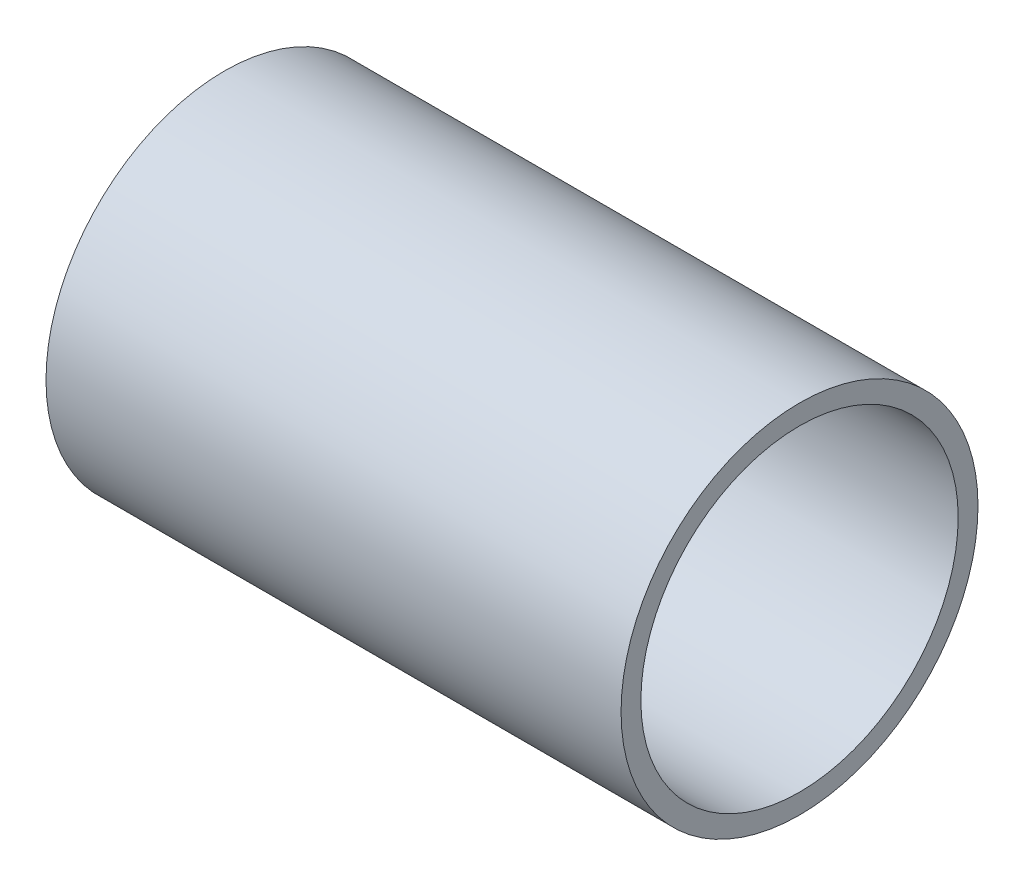
ISO-10303-21;
HEADER;
FILE_DESCRIPTION(('STEP AP214'),'2;1');
FILE_NAME('part.step','',(''),(''),'','','');
FILE_SCHEMA(('AUTOMOTIVE_DESIGN { 1 0 10303 214 1 1 1 1 }'));
ENDSEC;
DATA;
#1=APPLICATION_CONTEXT('core data for automotive mechanical design processes');
#2=APPLICATION_PROTOCOL_DEFINITION('international standard','automotive_design',2000,#1);
#3=PRODUCT_CONTEXT('',#1,'mechanical');
#4=PRODUCT('Part','Part','',(#3));
#5=PRODUCT_RELATED_PRODUCT_CATEGORY('part','',(#4));
#6=PRODUCT_DEFINITION_FORMATION('','',#4);
#7=PRODUCT_DEFINITION_CONTEXT('part definition',#1,'design');
#8=PRODUCT_DEFINITION('design','',#6,#7);
#9=PRODUCT_DEFINITION_SHAPE('','',#8);
#10=(LENGTH_UNIT() NAMED_UNIT(*) SI_UNIT(.MILLI.,.METRE.));
#11=(NAMED_UNIT(*) PLANE_ANGLE_UNIT() SI_UNIT($,.RADIAN.));
#12=(NAMED_UNIT(*) SI_UNIT($,.STERADIAN.) SOLID_ANGLE_UNIT());
#13=UNCERTAINTY_MEASURE_WITH_UNIT(LENGTH_MEASURE(1.E-05),#10,'distance_accuracy_value','');
#14=(GEOMETRIC_REPRESENTATION_CONTEXT(3) GLOBAL_UNCERTAINTY_ASSIGNED_CONTEXT((#13)) GLOBAL_UNIT_ASSIGNED_CONTEXT((#10,
#11,#12)) REPRESENTATION_CONTEXT('',''));
#15=CARTESIAN_POINT('',(0.,0.,0.));
#16=DIRECTION('',(0.,0.,1.));
#17=DIRECTION('',(1.,0.,0.));
#18=AXIS2_PLACEMENT_3D('',#15,#16,#17);
#19=CARTESIAN_POINT('',(145.,0.,0.));
#20=DIRECTION('',(1.,0.,0.));
#21=DIRECTION('',(0.,0.,-1.));
#22=AXIS2_PLACEMENT_3D('',#19,#20,#21);
#23=PLANE('',#22);
#24=CARTESIAN_POINT('',(145.,0.,0.));
#25=DIRECTION('',(1.,0.,0.));
#26=DIRECTION('',(0.,0.,-1.));
#27=AXIS2_PLACEMENT_3D('',#24,#25,#26);
#28=CIRCLE('',#27,45.);
#29=CARTESIAN_POINT('',(145.,0.,-45.));
#30=VERTEX_POINT('',#29);
#31=EDGE_CURVE('E10',#30,#30,#28,.T.);
#32=ORIENTED_EDGE('',*,*,#31,.T.);
#33=EDGE_LOOP('',(#32));
#34=FACE_BOUND('',#33,.T.);
#35=CARTESIAN_POINT('',(145.,0.,0.));
#36=DIRECTION('',(1.,0.,0.));
#37=DIRECTION('',(0.,0.,-1.));
#38=AXIS2_PLACEMENT_3D('',#35,#36,#37);
#39=CIRCLE('',#38,40.);
#40=CARTESIAN_POINT('',(145.,0.,-40.));
#41=VERTEX_POINT('',#40);
#42=EDGE_CURVE('E50',#41,#41,#39,.T.);
#43=ORIENTED_EDGE('',*,*,#42,.F.);
#44=EDGE_LOOP('',(#43));
#45=FACE_BOUND('',#44,.T.);
#46=ADVANCED_FACE('F39',(#34,#45),#23,.T.);
#47=CARTESIAN_POINT('',(0.,0.,0.));
#48=DIRECTION('',(1.,0.,0.));
#49=DIRECTION('',(0.,0.,-1.));
#50=AXIS2_PLACEMENT_3D('',#47,#48,#49);
#51=PLANE('',#50);
#52=CARTESIAN_POINT('',(0.,0.,0.));
#53=DIRECTION('',(1.,0.,0.));
#54=DIRECTION('',(0.,0.,-1.));
#55=AXIS2_PLACEMENT_3D('',#52,#53,#54);
#56=CIRCLE('',#55,45.);
#57=CARTESIAN_POINT('',(0.,0.,-45.));
#58=VERTEX_POINT('',#57);
#59=EDGE_CURVE('E43',#58,#58,#56,.T.);
#60=ORIENTED_EDGE('',*,*,#59,.F.);
#61=EDGE_LOOP('',(#60));
#62=FACE_BOUND('',#61,.T.);
#63=CARTESIAN_POINT('',(0.,0.,0.));
#64=DIRECTION('',(1.,0.,0.));
#65=DIRECTION('',(0.,0.,-1.));
#66=AXIS2_PLACEMENT_3D('',#63,#64,#65);
#67=CIRCLE('',#66,40.);
#68=CARTESIAN_POINT('',(0.,0.,-40.));
#69=VERTEX_POINT('',#68);
#70=EDGE_CURVE('E52',#69,#69,#67,.T.);
#71=ORIENTED_EDGE('',*,*,#70,.T.);
#72=EDGE_LOOP('',(#71));
#73=FACE_BOUND('',#72,.T.);
#74=ADVANCED_FACE('F62',(#62,#73),#51,.F.);
#75=CARTESIAN_POINT('',(145.,0.,0.));
#76=DIRECTION('',(-1.,0.,0.));
#77=DIRECTION('',(0.,0.,1.));
#78=AXIS2_PLACEMENT_3D('',#75,#76,#77);
#79=CYLINDRICAL_SURFACE('',#78,45.);
#80=ORIENTED_EDGE('',*,*,#31,.F.);
#81=EDGE_LOOP('',(#80));
#82=FACE_BOUND('',#81,.T.);
#83=ORIENTED_EDGE('',*,*,#59,.T.);
#84=EDGE_LOOP('',(#83));
#85=FACE_BOUND('',#84,.T.);
#86=ADVANCED_FACE('F41',(#82,#85),#79,.T.);
#87=CARTESIAN_POINT('',(145.,0.,0.));
#88=DIRECTION('',(-1.,0.,0.));
#89=DIRECTION('',(0.,0.,1.));
#90=AXIS2_PLACEMENT_3D('',#87,#88,#89);
#91=CYLINDRICAL_SURFACE('',#90,40.);
#92=ORIENTED_EDGE('',*,*,#42,.T.);
#93=EDGE_LOOP('',(#92));
#94=FACE_BOUND('',#93,.T.);
#95=ORIENTED_EDGE('',*,*,#70,.F.);
#96=EDGE_LOOP('',(#95));
#97=FACE_BOUND('',#96,.T.);
#98=ADVANCED_FACE('F58',(#94,#97),#91,.F.);
#99=CLOSED_SHELL('',(#46,#74,#86,#98));
#100=MANIFOLD_SOLID_BREP('B2',#99);
#101=ADVANCED_BREP_SHAPE_REPRESENTATION('',(#18,#100),#14);
#102=SHAPE_DEFINITION_REPRESENTATION(#9,#101);
ENDSEC;
END-ISO-10303-21;
